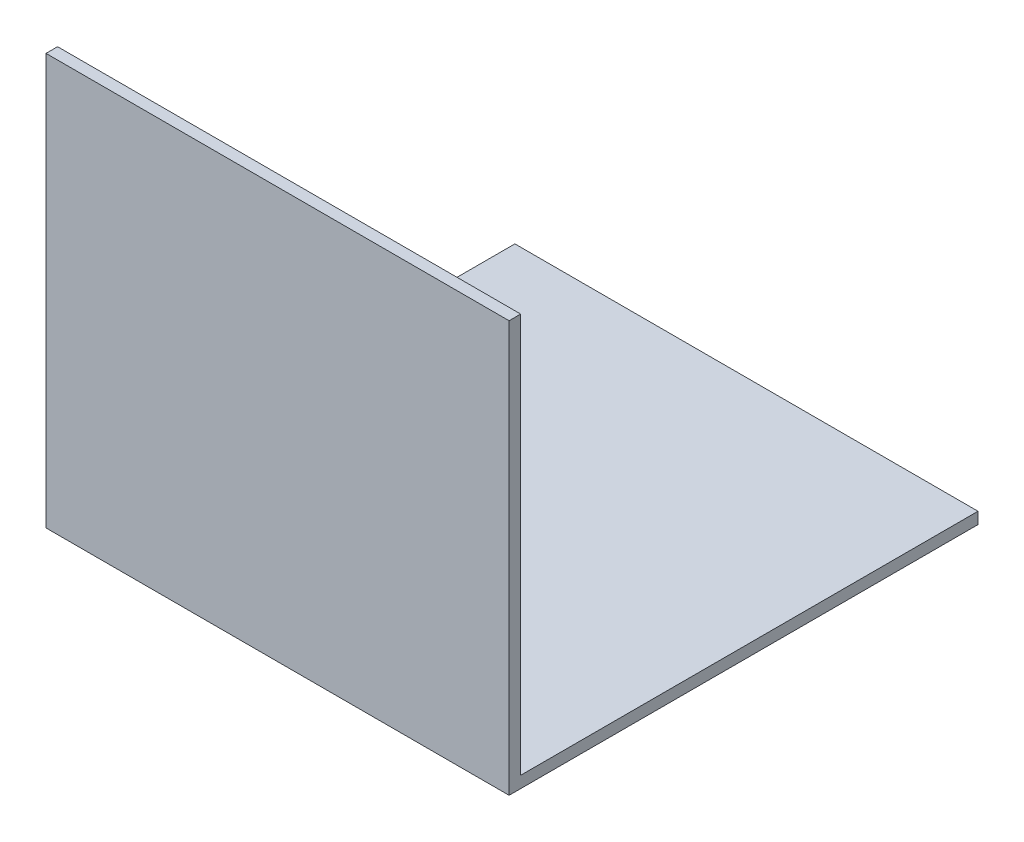
ISO-10303-21;
HEADER;
FILE_DESCRIPTION(('STEP AP214'),'2;1');
FILE_NAME('part.step','',(''),(''),'','','');
FILE_SCHEMA(('AUTOMOTIVE_DESIGN { 1 0 10303 214 1 1 1 1 }'));
ENDSEC;
DATA;
#1=APPLICATION_CONTEXT('core data for automotive mechanical design processes');
#2=APPLICATION_PROTOCOL_DEFINITION('international standard','automotive_design',2000,#1);
#3=PRODUCT_CONTEXT('',#1,'mechanical');
#4=PRODUCT('Part','Part','',(#3));
#5=PRODUCT_RELATED_PRODUCT_CATEGORY('part','',(#4));
#6=PRODUCT_DEFINITION_FORMATION('','',#4);
#7=PRODUCT_DEFINITION_CONTEXT('part definition',#1,'design');
#8=PRODUCT_DEFINITION('design','',#6,#7);
#9=PRODUCT_DEFINITION_SHAPE('','',#8);
#10=(LENGTH_UNIT() NAMED_UNIT(*) SI_UNIT(.MILLI.,.METRE.));
#11=(NAMED_UNIT(*) PLANE_ANGLE_UNIT() SI_UNIT($,.RADIAN.));
#12=(NAMED_UNIT(*) SI_UNIT($,.STERADIAN.) SOLID_ANGLE_UNIT());
#13=UNCERTAINTY_MEASURE_WITH_UNIT(LENGTH_MEASURE(1.E-05),#10,'distance_accuracy_value','');
#14=(GEOMETRIC_REPRESENTATION_CONTEXT(3) GLOBAL_UNCERTAINTY_ASSIGNED_CONTEXT((#13)) GLOBAL_UNIT_ASSIGNED_CONTEXT((#10,
#11,#12)) REPRESENTATION_CONTEXT('',''));
#15=CARTESIAN_POINT('',(0.,0.,0.));
#16=DIRECTION('',(0.,0.,1.));
#17=DIRECTION('',(1.,0.,0.));
#18=AXIS2_PLACEMENT_3D('',#15,#16,#17);
#19=CARTESIAN_POINT('',(800.,-10.,0.));
#20=DIRECTION('',(0.,1.,0.));
#21=DIRECTION('',(0.,0.,1.));
#22=AXIS2_PLACEMENT_3D('',#19,#20,#21);
#23=PLANE('',#22);
#24=DIRECTION('',(0.,0.,-1.));
#25=VECTOR('',#24,1.);
#26=CARTESIAN_POINT('',(0.,-10.,0.));
#27=LINE('',#26,#25);
#28=CARTESIAN_POINT('',(0.,-10.,10.));
#29=VERTEX_POINT('',#28);
#30=CARTESIAN_POINT('',(0.,-10.,-800.));
#31=VERTEX_POINT('',#30);
#32=EDGE_CURVE('E114',#29,#31,#27,.T.);
#33=ORIENTED_EDGE('',*,*,#32,.T.);
#34=DIRECTION('',(-1.,0.,0.));
#35=VECTOR('',#34,1.);
#36=CARTESIAN_POINT('',(800.,-10.,-800.));
#37=LINE('',#36,#35);
#38=CARTESIAN_POINT('',(800.,-10.,-800.));
#39=VERTEX_POINT('',#38);
#40=EDGE_CURVE('E11',#39,#31,#37,.T.);
#41=ORIENTED_EDGE('',*,*,#40,.F.);
#42=DIRECTION('',(0.,0.,-1.));
#43=VECTOR('',#42,1.);
#44=CARTESIAN_POINT('',(800.,-10.,0.));
#45=LINE('',#44,#43);
#46=CARTESIAN_POINT('',(800.,-10.,10.));
#47=VERTEX_POINT('',#46);
#48=EDGE_CURVE('E79',#47,#39,#45,.T.);
#49=ORIENTED_EDGE('',*,*,#48,.F.);
#50=DIRECTION('',(-1.,0.,0.));
#51=VECTOR('',#50,1.);
#52=CARTESIAN_POINT('',(800.,-10.,10.));
#53=LINE('',#52,#51);
#54=EDGE_CURVE('E110',#47,#29,#53,.T.);
#55=ORIENTED_EDGE('',*,*,#54,.T.);
#56=EDGE_LOOP('',(#33,#41,#49,#55));
#57=FACE_BOUND('',#56,.T.);
#58=ADVANCED_FACE('F33',(#57),#23,.F.);
#59=CARTESIAN_POINT('',(800.,10.,-800.));
#60=DIRECTION('',(0.,0.,-1.));
#61=DIRECTION('',(-1.,0.,0.));
#62=AXIS2_PLACEMENT_3D('',#59,#60,#61);
#63=PLANE('',#62);
#64=DIRECTION('',(0.,-1.,0.));
#65=VECTOR('',#64,1.);
#66=CARTESIAN_POINT('',(0.,10.,-800.));
#67=LINE('',#66,#65);
#68=CARTESIAN_POINT('',(0.,10.,-800.));
#69=VERTEX_POINT('',#68);
#70=EDGE_CURVE('E117',#69,#31,#67,.T.);
#71=ORIENTED_EDGE('',*,*,#70,.F.);
#72=DIRECTION('',(-1.,0.,0.));
#73=VECTOR('',#72,1.);
#74=CARTESIAN_POINT('',(800.,10.,-800.));
#75=LINE('',#74,#73);
#76=CARTESIAN_POINT('',(800.,10.,-800.));
#77=VERTEX_POINT('',#76);
#78=EDGE_CURVE('E41',#77,#69,#75,.T.);
#79=ORIENTED_EDGE('',*,*,#78,.F.);
#80=DIRECTION('',(0.,-1.,0.));
#81=VECTOR('',#80,1.);
#82=CARTESIAN_POINT('',(800.,10.,-800.));
#83=LINE('',#82,#81);
#84=EDGE_CURVE('E203',#77,#39,#83,.T.);
#85=ORIENTED_EDGE('',*,*,#84,.T.);
#86=ORIENTED_EDGE('',*,*,#40,.T.);
#87=EDGE_LOOP('',(#71,#79,#85,#86));
#88=FACE_BOUND('',#87,.T.);
#89=ADVANCED_FACE('F135',(#88),#63,.T.);
#90=CARTESIAN_POINT('',(800.,10.,0.));
#91=DIRECTION('',(0.,1.,0.));
#92=DIRECTION('',(0.,0.,1.));
#93=AXIS2_PLACEMENT_3D('',#90,#91,#92);
#94=PLANE('',#93);
#95=DIRECTION('',(0.,0.,-1.));
#96=VECTOR('',#95,1.);
#97=CARTESIAN_POINT('',(0.,10.,0.));
#98=LINE('',#97,#96);
#99=CARTESIAN_POINT('',(0.,10.,-10.));
#100=VERTEX_POINT('',#99);
#101=EDGE_CURVE('E120',#100,#69,#98,.T.);
#102=ORIENTED_EDGE('',*,*,#101,.F.);
#103=DIRECTION('',(-1.,0.,0.));
#104=VECTOR('',#103,1.);
#105=CARTESIAN_POINT('',(800.,10.,-10.));
#106=LINE('',#105,#104);
#107=CARTESIAN_POINT('',(800.,10.,-10.));
#108=VERTEX_POINT('',#107);
#109=EDGE_CURVE('E100',#108,#100,#106,.T.);
#110=ORIENTED_EDGE('',*,*,#109,.F.);
#111=DIRECTION('',(0.,0.,-1.));
#112=VECTOR('',#111,1.);
#113=CARTESIAN_POINT('',(800.,10.,0.));
#114=LINE('',#113,#112);
#115=EDGE_CURVE('E106',#108,#77,#114,.T.);
#116=ORIENTED_EDGE('',*,*,#115,.T.);
#117=ORIENTED_EDGE('',*,*,#78,.T.);
#118=EDGE_LOOP('',(#102,#110,#116,#117));
#119=FACE_BOUND('',#118,.T.);
#120=ADVANCED_FACE('F132',(#119),#94,.T.);
#121=CARTESIAN_POINT('',(800.,700.,-10.));
#122=DIRECTION('',(0.,0.,-1.));
#123=DIRECTION('',(-1.,0.,0.));
#124=AXIS2_PLACEMENT_3D('',#121,#122,#123);
#125=PLANE('',#124);
#126=DIRECTION('',(0.,1.,0.));
#127=VECTOR('',#126,1.);
#128=CARTESIAN_POINT('',(0.,700.,-10.));
#129=LINE('',#128,#127);
#130=CARTESIAN_POINT('',(0.,700.,-10.));
#131=VERTEX_POINT('',#130);
#132=EDGE_CURVE('E95',#131,#100,#129,.F.);
#133=ORIENTED_EDGE('',*,*,#132,.F.);
#134=DIRECTION('',(-1.,0.,0.));
#135=VECTOR('',#134,1.);
#136=CARTESIAN_POINT('',(800.,700.,-10.));
#137=LINE('',#136,#135);
#138=CARTESIAN_POINT('',(800.,700.,-10.));
#139=VERTEX_POINT('',#138);
#140=EDGE_CURVE('E90',#139,#131,#137,.T.);
#141=ORIENTED_EDGE('',*,*,#140,.F.);
#142=DIRECTION('',(0.,1.,0.));
#143=VECTOR('',#142,1.);
#144=CARTESIAN_POINT('',(800.,700.,-10.));
#145=LINE('',#144,#143);
#146=EDGE_CURVE('E93',#139,#108,#145,.F.);
#147=ORIENTED_EDGE('',*,*,#146,.T.);
#148=ORIENTED_EDGE('',*,*,#109,.T.);
#149=EDGE_LOOP('',(#133,#141,#147,#148));
#150=FACE_BOUND('',#149,.T.);
#151=ADVANCED_FACE('F92',(#150),#125,.T.);
#152=CARTESIAN_POINT('',(800.,700.,10.));
#153=DIRECTION('',(0.,1.,0.));
#154=DIRECTION('',(0.,0.,1.));
#155=AXIS2_PLACEMENT_3D('',#152,#153,#154);
#156=PLANE('',#155);
#157=DIRECTION('',(0.,0.,-1.));
#158=VECTOR('',#157,1.);
#159=CARTESIAN_POINT('',(0.,700.,10.));
#160=LINE('',#159,#158);
#161=CARTESIAN_POINT('',(0.,700.,10.));
#162=VERTEX_POINT('',#161);
#163=EDGE_CURVE('E124',#162,#131,#160,.T.);
#164=ORIENTED_EDGE('',*,*,#163,.F.);
#165=DIRECTION('',(-1.,0.,0.));
#166=VECTOR('',#165,1.);
#167=CARTESIAN_POINT('',(800.,700.,10.));
#168=LINE('',#167,#166);
#169=CARTESIAN_POINT('',(800.,700.,10.));
#170=VERTEX_POINT('',#169);
#171=EDGE_CURVE('E70',#170,#162,#168,.T.);
#172=ORIENTED_EDGE('',*,*,#171,.F.);
#173=DIRECTION('',(0.,0.,-1.));
#174=VECTOR('',#173,1.);
#175=CARTESIAN_POINT('',(800.,700.,10.));
#176=LINE('',#175,#174);
#177=EDGE_CURVE('E104',#170,#139,#176,.T.);
#178=ORIENTED_EDGE('',*,*,#177,.T.);
#179=ORIENTED_EDGE('',*,*,#140,.T.);
#180=EDGE_LOOP('',(#164,#172,#178,#179));
#181=FACE_BOUND('',#180,.T.);
#182=ADVANCED_FACE('F108',(#181),#156,.T.);
#183=CARTESIAN_POINT('',(800.,700.,10.));
#184=DIRECTION('',(0.,0.,-1.));
#185=DIRECTION('',(-1.,0.,0.));
#186=AXIS2_PLACEMENT_3D('',#183,#184,#185);
#187=PLANE('',#186);
#188=DIRECTION('',(0.,1.,0.));
#189=VECTOR('',#188,1.);
#190=CARTESIAN_POINT('',(0.,700.,10.));
#191=LINE('',#190,#189);
#192=EDGE_CURVE('E73',#162,#29,#191,.F.);
#193=ORIENTED_EDGE('',*,*,#192,.T.);
#194=ORIENTED_EDGE('',*,*,#54,.F.);
#195=DIRECTION('',(0.,1.,0.));
#196=VECTOR('',#195,1.);
#197=CARTESIAN_POINT('',(800.,700.,10.));
#198=LINE('',#197,#196);
#199=EDGE_CURVE('E49',#170,#47,#198,.F.);
#200=ORIENTED_EDGE('',*,*,#199,.F.);
#201=ORIENTED_EDGE('',*,*,#171,.T.);
#202=EDGE_LOOP('',(#193,#194,#200,#201));
#203=FACE_BOUND('',#202,.T.);
#204=ADVANCED_FACE('F140',(#203),#187,.F.);
#205=CARTESIAN_POINT('',(800.,0.,0.));
#206=DIRECTION('',(-1.,0.,0.));
#207=DIRECTION('',(0.,0.,1.));
#208=AXIS2_PLACEMENT_3D('',#205,#206,#207);
#209=PLANE('',#208);
#210=ORIENTED_EDGE('',*,*,#48,.T.);
#211=ORIENTED_EDGE('',*,*,#84,.F.);
#212=ORIENTED_EDGE('',*,*,#115,.F.);
#213=ORIENTED_EDGE('',*,*,#146,.F.);
#214=ORIENTED_EDGE('',*,*,#177,.F.);
#215=ORIENTED_EDGE('',*,*,#199,.T.);
#216=EDGE_LOOP('',(#210,#211,#212,#213,#214,#215));
#217=FACE_BOUND('',#216,.T.);
#218=ADVANCED_FACE('F103',(#217),#209,.F.);
#219=CARTESIAN_POINT('',(0.,0.,0.));
#220=DIRECTION('',(-1.,0.,0.));
#221=DIRECTION('',(0.,0.,1.));
#222=AXIS2_PLACEMENT_3D('',#219,#220,#221);
#223=PLANE('',#222);
#224=ORIENTED_EDGE('',*,*,#32,.F.);
#225=ORIENTED_EDGE('',*,*,#192,.F.);
#226=ORIENTED_EDGE('',*,*,#163,.T.);
#227=ORIENTED_EDGE('',*,*,#132,.T.);
#228=ORIENTED_EDGE('',*,*,#101,.T.);
#229=ORIENTED_EDGE('',*,*,#70,.T.);
#230=EDGE_LOOP('',(#224,#225,#226,#227,#228,#229));
#231=FACE_BOUND('',#230,.T.);
#232=ADVANCED_FACE('F138',(#231),#223,.T.);
#233=CLOSED_SHELL('',(#58,#89,#120,#151,#182,#204,#218,#232));
#234=MANIFOLD_SOLID_BREP('B2',#233);
#235=ADVANCED_BREP_SHAPE_REPRESENTATION('',(#18,#234),#14);
#236=SHAPE_DEFINITION_REPRESENTATION(#9,#235);
ENDSEC;
END-ISO-10303-21;
